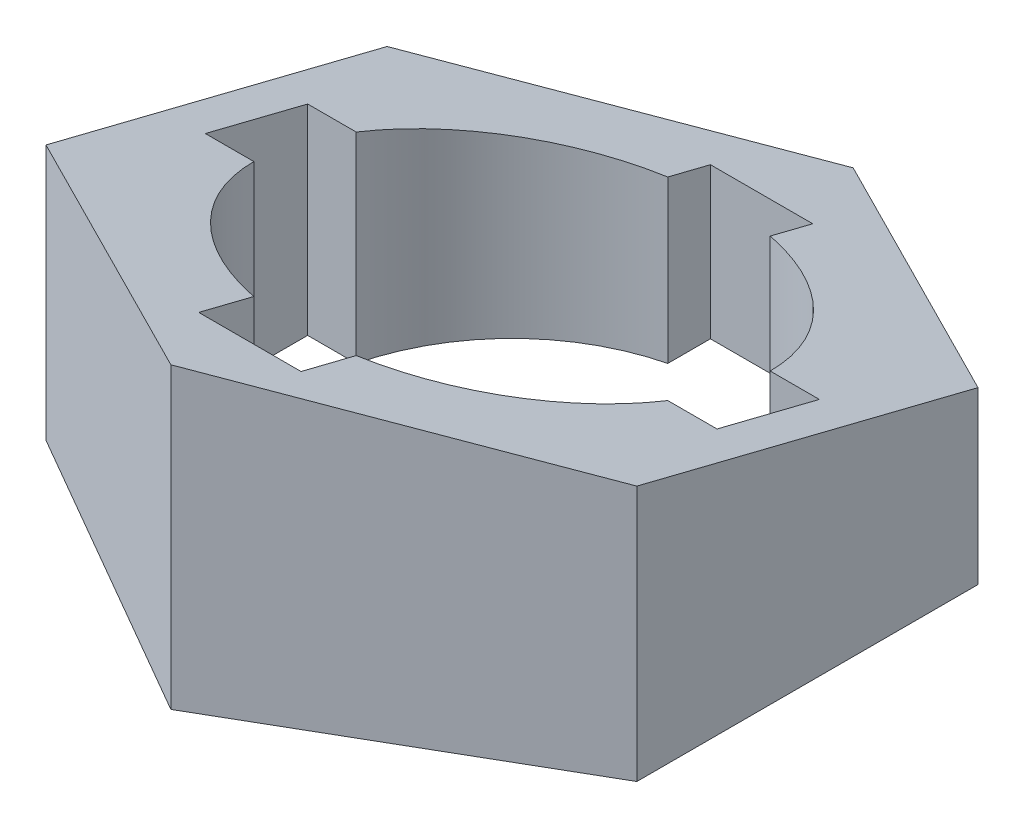
ISO-10303-21;
HEADER;
FILE_DESCRIPTION(('STEP AP214'),'2;1');
FILE_NAME('part.step','',(''),(''),'','','');
FILE_SCHEMA(('AUTOMOTIVE_DESIGN { 1 0 10303 214 1 1 1 1 }'));
ENDSEC;
DATA;
#1=APPLICATION_CONTEXT('core data for automotive mechanical design processes');
#2=APPLICATION_PROTOCOL_DEFINITION('international standard','automotive_design',2000,#1);
#3=PRODUCT_CONTEXT('',#1,'mechanical');
#4=PRODUCT('Part','Part','',(#3));
#5=PRODUCT_RELATED_PRODUCT_CATEGORY('part','',(#4));
#6=PRODUCT_DEFINITION_FORMATION('','',#4);
#7=PRODUCT_DEFINITION_CONTEXT('part definition',#1,'design');
#8=PRODUCT_DEFINITION('design','',#6,#7);
#9=PRODUCT_DEFINITION_SHAPE('','',#8);
#10=(LENGTH_UNIT() NAMED_UNIT(*) SI_UNIT(.MILLI.,.METRE.));
#11=(NAMED_UNIT(*) PLANE_ANGLE_UNIT() SI_UNIT($,.RADIAN.));
#12=(NAMED_UNIT(*) SI_UNIT($,.STERADIAN.) SOLID_ANGLE_UNIT());
#13=UNCERTAINTY_MEASURE_WITH_UNIT(LENGTH_MEASURE(1.E-05),#10,'distance_accuracy_value','');
#14=(GEOMETRIC_REPRESENTATION_CONTEXT(3) GLOBAL_UNCERTAINTY_ASSIGNED_CONTEXT((#13)) GLOBAL_UNIT_ASSIGNED_CONTEXT((#10,
#11,#12)) REPRESENTATION_CONTEXT('',''));
#15=CARTESIAN_POINT('',(0.,0.,0.));
#16=DIRECTION('',(0.,0.,1.));
#17=DIRECTION('',(1.,0.,0.));
#18=AXIS2_PLACEMENT_3D('',#15,#16,#17);
#19=CARTESIAN_POINT('',(34.6410161513773,35.,-20.0000000000004));
#20=DIRECTION('',(-0.499999999999995,0.,0.866025403784441));
#21=DIRECTION('',(0.866025403784441,0.,0.499999999999995));
#22=AXIS2_PLACEMENT_3D('',#19,#20,#21);
#23=PLANE('',#22);
#24=DIRECTION('',(-0.859337848847322,-0.124034734589208,-0.496138938356829));
#25=VECTOR('',#24,1.);
#26=CARTESIAN_POINT('',(36.2398322814409,20.2307692307692,-19.0769230769235));
#27=LINE('',#26,#25);
#28=CARTESIAN_POINT('',(34.6410161513778,19.9999999999999,-20.0000000000004));
#29=VERTEX_POINT('',#28);
#30=CARTESIAN_POINT('',(0.,15.,-40.));
#31=VERTEX_POINT('',#30);
#32=EDGE_CURVE('E328',#29,#31,#27,.T.);
#33=ORIENTED_EDGE('',*,*,#32,.F.);
#34=DIRECTION('',(0.,-1.,0.));
#35=VECTOR('',#34,1.);
#36=CARTESIAN_POINT('',(34.6410161513773,35.,-20.0000000000004));
#37=LINE('',#36,#35);
#38=CARTESIAN_POINT('',(34.6410161513773,0.,-20.0000000000004));
#39=VERTEX_POINT('',#38);
#40=EDGE_CURVE('E218',#29,#39,#37,.T.);
#41=ORIENTED_EDGE('',*,*,#40,.T.);
#42=DIRECTION('',(-0.866025403784441,0.,-0.499999999999995));
#43=VECTOR('',#42,1.);
#44=CARTESIAN_POINT('',(34.6410161513773,0.,-20.0000000000004));
#45=LINE('',#44,#43);
#46=CARTESIAN_POINT('',(0.,0.,-40.));
#47=VERTEX_POINT('',#46);
#48=EDGE_CURVE('E240',#39,#47,#45,.T.);
#49=ORIENTED_EDGE('',*,*,#48,.T.);
#50=DIRECTION('',(0.,-1.,0.));
#51=VECTOR('',#50,1.);
#52=CARTESIAN_POINT('',(0.,35.,-40.));
#53=LINE('',#52,#51);
#54=EDGE_CURVE('E49',#31,#47,#53,.T.);
#55=ORIENTED_EDGE('',*,*,#54,.F.);
#56=EDGE_LOOP('',(#33,#41,#49,#55));
#57=FACE_BOUND('',#56,.T.);
#58=ADVANCED_FACE('F41',(#57),#23,.F.);
#59=CARTESIAN_POINT('',(0.,35.,-40.));
#60=DIRECTION('',(0.500000000000001,0.,0.866025403784438));
#61=DIRECTION('',(0.866025403784438,0.,-0.500000000000001));
#62=AXIS2_PLACEMENT_3D('',#59,#60,#61);
#63=PLANE('',#62);
#64=DIRECTION('',(-0.859337848847319,0.124034734589208,0.496138938356835));
#65=VECTOR('',#64,1.);
#66=CARTESIAN_POINT('',(-2.13175484008476,15.3076923076923,-38.7692307692308));
#67=LINE('',#66,#65);
#68=CARTESIAN_POINT('',(-34.6410161513776,20.,-19.9999999999999));
#69=VERTEX_POINT('',#68);
#70=EDGE_CURVE('E195',#31,#69,#67,.T.);
#71=ORIENTED_EDGE('',*,*,#70,.F.);
#72=ORIENTED_EDGE('',*,*,#54,.T.);
#73=DIRECTION('',(-0.866025403784438,0.,0.500000000000001));
#74=VECTOR('',#73,1.);
#75=CARTESIAN_POINT('',(0.,0.,-40.));
#76=LINE('',#75,#74);
#77=CARTESIAN_POINT('',(-34.6410161513776,0.,-19.9999999999999));
#78=VERTEX_POINT('',#77);
#79=EDGE_CURVE('E231',#47,#78,#76,.T.);
#80=ORIENTED_EDGE('',*,*,#79,.T.);
#81=DIRECTION('',(0.,-1.,0.));
#82=VECTOR('',#81,1.);
#83=CARTESIAN_POINT('',(-34.6410161513776,35.,-19.9999999999999));
#84=LINE('',#83,#82);
#85=EDGE_CURVE('E216',#69,#78,#84,.T.);
#86=ORIENTED_EDGE('',*,*,#85,.F.);
#87=EDGE_LOOP('',(#71,#72,#80,#86));
#88=FACE_BOUND('',#87,.T.);
#89=ADVANCED_FACE('F229',(#88),#63,.F.);
#90=CARTESIAN_POINT('',(-34.6410161513776,35.,-19.9999999999999));
#91=DIRECTION('',(1.,0.,0.));
#92=DIRECTION('',(0.,0.,-1.));
#93=AXIS2_PLACEMENT_3D('',#90,#91,#92);
#94=PLANE('',#93);
#95=DIRECTION('',(0.,-0.242535625036333,-0.970142500145332));
#96=VECTOR('',#95,1.);
#97=CARTESIAN_POINT('',(-34.6410161513775,23.5294117647059,-5.88235294117636));
#98=LINE('',#97,#96);
#99=CARTESIAN_POINT('',(-34.6410161513775,30.,20.0000000000002));
#100=VERTEX_POINT('',#99);
#101=EDGE_CURVE('E190',#100,#69,#98,.T.);
#102=ORIENTED_EDGE('',*,*,#101,.T.);
#103=ORIENTED_EDGE('',*,*,#85,.T.);
#104=DIRECTION('',(0.,0.,1.));
#105=VECTOR('',#104,1.);
#106=CARTESIAN_POINT('',(-34.6410161513776,0.,-19.9999999999999));
#107=LINE('',#106,#105);
#108=CARTESIAN_POINT('',(-34.6410161513775,0.,20.0000000000002));
#109=VERTEX_POINT('',#108);
#110=EDGE_CURVE('E242',#78,#109,#107,.T.);
#111=ORIENTED_EDGE('',*,*,#110,.T.);
#112=DIRECTION('',(0.,-1.,0.));
#113=VECTOR('',#112,1.);
#114=CARTESIAN_POINT('',(-34.6410161513775,35.,20.0000000000002));
#115=LINE('',#114,#113);
#116=EDGE_CURVE('E212',#100,#109,#115,.T.);
#117=ORIENTED_EDGE('',*,*,#116,.F.);
#118=EDGE_LOOP('',(#102,#103,#111,#117));
#119=FACE_BOUND('',#118,.T.);
#120=ADVANCED_FACE('F518',(#119),#94,.F.);
#121=CARTESIAN_POINT('',(-34.6410161513775,35.,20.0000000000002));
#122=DIRECTION('',(0.499999999999995,0.,-0.866025403784442));
#123=DIRECTION('',(-0.866025403784442,0.,-0.499999999999995));
#124=AXIS2_PLACEMENT_3D('',#121,#122,#123);
#125=PLANE('',#124);
#126=DIRECTION('',(0.859337848847322,0.124034734589208,0.496138938356829));
#127=VECTOR('',#126,1.);
#128=CARTESIAN_POINT('',(-34.1080774413563,30.0769230769231,20.3076923076925));
#129=LINE('',#128,#127);
#130=CARTESIAN_POINT('',(2.77555756156289E-13,35.,40.));
#131=VERTEX_POINT('',#130);
#132=EDGE_CURVE('E187',#100,#131,#129,.T.);
#133=ORIENTED_EDGE('',*,*,#132,.F.);
#134=ORIENTED_EDGE('',*,*,#116,.T.);
#135=DIRECTION('',(0.866025403784442,0.,0.499999999999995));
#136=VECTOR('',#135,1.);
#137=CARTESIAN_POINT('',(-34.6410161513775,0.,20.0000000000002));
#138=LINE('',#137,#136);
#139=CARTESIAN_POINT('',(2.79318507107451E-13,0.,40.));
#140=VERTEX_POINT('',#139);
#141=EDGE_CURVE('E210',#109,#140,#138,.T.);
#142=ORIENTED_EDGE('',*,*,#141,.T.);
#143=DIRECTION('',(0.,-1.,0.));
#144=VECTOR('',#143,1.);
#145=CARTESIAN_POINT('',(2.79318507107451E-13,35.,40.));
#146=LINE('',#145,#144);
#147=EDGE_CURVE('E202',#131,#140,#146,.T.);
#148=ORIENTED_EDGE('',*,*,#147,.F.);
#149=EDGE_LOOP('',(#133,#134,#142,#148));
#150=FACE_BOUND('',#149,.T.);
#151=ADVANCED_FACE('F208',(#150),#125,.F.);
#152=CARTESIAN_POINT('',(2.79318507107451E-13,35.,40.));
#153=DIRECTION('',(-0.500000000000007,0.,-0.866025403784435));
#154=DIRECTION('',(-0.866025403784435,0.,0.500000000000007));
#155=AXIS2_PLACEMENT_3D('',#152,#153,#154);
#156=PLANE('',#155);
#157=DIRECTION('',(0.859337848847315,-0.124034734589209,-0.496138938356841));
#158=VECTOR('',#157,1.);
#159=CARTESIAN_POINT('',(2.79318507107451E-13,35.,40.));
#160=LINE('',#159,#158);
#161=CARTESIAN_POINT('',(34.6410161513777,30.,19.9999999999997));
#162=VERTEX_POINT('',#161);
#163=EDGE_CURVE('E56',#131,#162,#160,.T.);
#164=ORIENTED_EDGE('',*,*,#163,.F.);
#165=ORIENTED_EDGE('',*,*,#147,.T.);
#166=DIRECTION('',(0.866025403784435,0.,-0.500000000000007));
#167=VECTOR('',#166,1.);
#168=CARTESIAN_POINT('',(2.79318507107451E-13,0.,40.));
#169=LINE('',#168,#167);
#170=CARTESIAN_POINT('',(34.6410161513777,0.,19.9999999999997));
#171=VERTEX_POINT('',#170);
#172=EDGE_CURVE('E262',#140,#171,#169,.T.);
#173=ORIENTED_EDGE('',*,*,#172,.T.);
#174=DIRECTION('',(0.,-1.,0.));
#175=VECTOR('',#174,1.);
#176=CARTESIAN_POINT('',(34.6410161513777,35.,19.9999999999997));
#177=LINE('',#176,#175);
#178=EDGE_CURVE('E204',#162,#171,#177,.T.);
#179=ORIENTED_EDGE('',*,*,#178,.F.);
#180=EDGE_LOOP('',(#164,#165,#173,#179));
#181=FACE_BOUND('',#180,.T.);
#182=ADVANCED_FACE('F200',(#181),#156,.F.);
#183=CARTESIAN_POINT('',(34.6410161513777,35.,19.9999999999997));
#184=DIRECTION('',(-1.,0.,0.));
#185=DIRECTION('',(0.,0.,1.));
#186=AXIS2_PLACEMENT_3D('',#183,#184,#185);
#187=PLANE('',#186);
#188=DIRECTION('',(0.,-0.242535625036333,-0.970142500145332));
#189=VECTOR('',#188,1.);
#190=CARTESIAN_POINT('',(34.6410161513778,23.5294117647059,-5.88235294117659));
#191=LINE('',#190,#189);
#192=EDGE_CURVE('E270',#162,#29,#191,.T.);
#193=ORIENTED_EDGE('',*,*,#192,.F.);
#194=ORIENTED_EDGE('',*,*,#178,.T.);
#195=DIRECTION('',(0.,0.,-1.));
#196=VECTOR('',#195,1.);
#197=CARTESIAN_POINT('',(34.6410161513777,0.,19.9999999999997));
#198=LINE('',#197,#196);
#199=EDGE_CURVE('E265',#171,#39,#198,.T.);
#200=ORIENTED_EDGE('',*,*,#199,.T.);
#201=ORIENTED_EDGE('',*,*,#40,.F.);
#202=EDGE_LOOP('',(#193,#194,#200,#201));
#203=FACE_BOUND('',#202,.T.);
#204=ADVANCED_FACE('F269',(#203),#187,.F.);
#205=CARTESIAN_POINT('',(-6.,0.,30.7340250650547));
#206=DIRECTION('',(0.,0.,1.));
#207=DIRECTION('',(1.,0.,0.));
#208=AXIS2_PLACEMENT_3D('',#205,#206,#207);
#209=PLANE('',#208);
#210=DIRECTION('',(-1.,0.,0.));
#211=VECTOR('',#210,1.);
#212=CARTESIAN_POINT('',(-6.00000000000003,32.6835062662637,30.7340250650547));
#213=LINE('',#212,#211);
#214=CARTESIAN_POINT('',(6.,32.6835062662637,30.7340250650547));
#215=VERTEX_POINT('',#214);
#216=CARTESIAN_POINT('',(-6.,32.6835062662637,30.7340250650547));
#217=VERTEX_POINT('',#216);
#218=EDGE_CURVE('E206',#215,#217,#213,.T.);
#219=ORIENTED_EDGE('',*,*,#218,.F.);
#220=DIRECTION('',(0.,1.,0.));
#221=VECTOR('',#220,1.);
#222=CARTESIAN_POINT('',(6.,0.,30.7340250650547));
#223=LINE('',#222,#221);
#224=CARTESIAN_POINT('',(6.,0.,30.7340250650547));
#225=VERTEX_POINT('',#224);
#226=EDGE_CURVE('E255',#225,#215,#223,.T.);
#227=ORIENTED_EDGE('',*,*,#226,.F.);
#228=DIRECTION('',(1.,0.,0.));
#229=VECTOR('',#228,1.);
#230=CARTESIAN_POINT('',(-6.,0.,30.7340250650547));
#231=LINE('',#230,#229);
#232=CARTESIAN_POINT('',(-6.,0.,30.7340250650547));
#233=VERTEX_POINT('',#232);
#234=EDGE_CURVE('E331',#233,#225,#231,.T.);
#235=ORIENTED_EDGE('',*,*,#234,.F.);
#236=DIRECTION('',(0.,1.,0.));
#237=VECTOR('',#236,1.);
#238=CARTESIAN_POINT('',(-6.,0.,30.7340250650547));
#239=LINE('',#238,#237);
#240=EDGE_CURVE('E248',#233,#217,#239,.T.);
#241=ORIENTED_EDGE('',*,*,#240,.T.);
#242=EDGE_LOOP('',(#219,#227,#235,#241));
#243=FACE_BOUND('',#242,.T.);
#244=ADVANCED_FACE('F451',(#243),#209,.F.);
#245=CARTESIAN_POINT('',(-6.,0.,30.7340250650547));
#246=DIRECTION('',(1.,0.,0.));
#247=DIRECTION('',(0.,0.,-1.));
#248=AXIS2_PLACEMENT_3D('',#245,#246,#247);
#249=PLANE('',#248);
#250=DIRECTION('',(0.,1.,0.));
#251=VECTOR('',#250,1.);
#252=CARTESIAN_POINT('',(-6.00000000000001,0.,24.2693221990232));
#253=LINE('',#252,#251);
#254=CARTESIAN_POINT('',(-6.00000000000001,0.,24.2693221990232));
#255=VERTEX_POINT('',#254);
#256=CARTESIAN_POINT('',(-6.00000000000001,31.0673305497558,24.2693221990232));
#257=VERTEX_POINT('',#256);
#258=EDGE_CURVE('E252',#255,#257,#253,.T.);
#259=ORIENTED_EDGE('',*,*,#258,.T.);
#260=DIRECTION('',(0.,0.242535625036333,0.970142500145332));
#261=VECTOR('',#260,1.);
#262=CARTESIAN_POINT('',(-6.,30.7609470741305,23.0437882965221));
#263=LINE('',#262,#261);
#264=EDGE_CURVE('E320',#257,#217,#263,.T.);
#265=ORIENTED_EDGE('',*,*,#264,.T.);
#266=ORIENTED_EDGE('',*,*,#240,.F.);
#267=DIRECTION('',(0.,0.,-1.));
#268=VECTOR('',#267,1.);
#269=CARTESIAN_POINT('',(-6.,0.,30.7340250650547));
#270=LINE('',#269,#268);
#271=EDGE_CURVE('E385',#233,#255,#270,.T.);
#272=ORIENTED_EDGE('',*,*,#271,.T.);
#273=EDGE_LOOP('',(#259,#265,#266,#272));
#274=FACE_BOUND('',#273,.T.);
#275=ADVANCED_FACE('F455',(#274),#249,.T.);
#276=CARTESIAN_POINT('',(0.,0.,0.));
#277=DIRECTION('',(0.,1.,0.));
#278=DIRECTION('',(0.,0.,1.));
#279=AXIS2_PLACEMENT_3D('',#276,#277,#278);
#280=CYLINDRICAL_SURFACE('',#279,25.);
#281=CARTESIAN_POINT('',(0.,25.,0.));
#282=DIRECTION('',(0.,0.970142500145332,-0.242535625036333));
#283=DIRECTION('',(0.,0.242535625036333,0.970142500145332));
#284=AXIS2_PLACEMENT_3D('',#281,#282,#283);
#285=ELLIPSE('',#284,25.7694101601104,25.);
#286=CARTESIAN_POINT('',(-24.2693221990232,26.5,6.));
#287=VERTEX_POINT('',#286);
#288=EDGE_CURVE('E317',#257,#287,#285,.F.);
#289=ORIENTED_EDGE('',*,*,#288,.F.);
#290=ORIENTED_EDGE('',*,*,#258,.F.);
#291=CARTESIAN_POINT('',(0.,0.,0.));
#292=DIRECTION('',(0.,1.,0.));
#293=DIRECTION('',(0.,0.,1.));
#294=AXIS2_PLACEMENT_3D('',#291,#292,#293);
#295=CIRCLE('',#294,25.);
#296=CARTESIAN_POINT('',(-24.2693221990232,0.,6.));
#297=VERTEX_POINT('',#296);
#298=EDGE_CURVE('E381',#297,#255,#295,.T.);
#299=ORIENTED_EDGE('',*,*,#298,.F.);
#300=DIRECTION('',(0.,1.,0.));
#301=VECTOR('',#300,1.);
#302=CARTESIAN_POINT('',(-24.2693221990232,0.,6.));
#303=LINE('',#302,#301);
#304=EDGE_CURVE('E391',#297,#287,#303,.T.);
#305=ORIENTED_EDGE('',*,*,#304,.T.);
#306=EDGE_LOOP('',(#289,#290,#299,#305));
#307=FACE_BOUND('',#306,.T.);
#308=ADVANCED_FACE('F459',(#307),#280,.F.);
#309=CARTESIAN_POINT('',(-29.959606462965,0.,6.));
#310=DIRECTION('',(0.,0.,1.));
#311=DIRECTION('',(1.,0.,0.));
#312=AXIS2_PLACEMENT_3D('',#309,#310,#311);
#313=PLANE('',#312);
#314=DIRECTION('',(-1.,0.,0.));
#315=VECTOR('',#314,1.);
#316=CARTESIAN_POINT('',(-29.9596064629651,26.5,6.));
#317=LINE('',#316,#315);
#318=CARTESIAN_POINT('',(-29.959606462965,26.5,6.));
#319=VERTEX_POINT('',#318);
#320=EDGE_CURVE('E314',#287,#319,#317,.T.);
#321=ORIENTED_EDGE('',*,*,#320,.F.);
#322=ORIENTED_EDGE('',*,*,#304,.F.);
#323=DIRECTION('',(1.,0.,0.));
#324=VECTOR('',#323,1.);
#325=CARTESIAN_POINT('',(-29.959606462965,0.,6.));
#326=LINE('',#325,#324);
#327=CARTESIAN_POINT('',(-29.959606462965,0.,6.));
#328=VERTEX_POINT('',#327);
#329=EDGE_CURVE('E377',#328,#297,#326,.T.);
#330=ORIENTED_EDGE('',*,*,#329,.F.);
#331=DIRECTION('',(0.,1.,0.));
#332=VECTOR('',#331,1.);
#333=CARTESIAN_POINT('',(-29.959606462965,0.,6.));
#334=LINE('',#333,#332);
#335=EDGE_CURVE('E395',#328,#319,#334,.T.);
#336=ORIENTED_EDGE('',*,*,#335,.T.);
#337=EDGE_LOOP('',(#321,#322,#330,#336));
#338=FACE_BOUND('',#337,.T.);
#339=ADVANCED_FACE('F466',(#338),#313,.F.);
#340=CARTESIAN_POINT('',(-29.959606462965,0.,6.));
#341=DIRECTION('',(1.,0.,0.));
#342=DIRECTION('',(0.,0.,-1.));
#343=AXIS2_PLACEMENT_3D('',#340,#341,#342);
#344=PLANE('',#343);
#345=DIRECTION('',(0.,1.,0.));
#346=VECTOR('',#345,1.);
#347=CARTESIAN_POINT('',(-29.959606462965,0.,-6.));
#348=LINE('',#347,#346);
#349=CARTESIAN_POINT('',(-29.959606462965,0.,-6.));
#350=VERTEX_POINT('',#349);
#351=CARTESIAN_POINT('',(-29.959606462965,23.5,-6.));
#352=VERTEX_POINT('',#351);
#353=EDGE_CURVE('E399',#350,#352,#348,.T.);
#354=ORIENTED_EDGE('',*,*,#353,.T.);
#355=DIRECTION('',(0.,0.242535625036333,0.970142500145332));
#356=VECTOR('',#355,1.);
#357=CARTESIAN_POINT('',(-29.959606462965,24.9411764705882,-0.235294117647055));
#358=LINE('',#357,#356);
#359=EDGE_CURVE('E310',#352,#319,#358,.T.);
#360=ORIENTED_EDGE('',*,*,#359,.T.);
#361=ORIENTED_EDGE('',*,*,#335,.F.);
#362=DIRECTION('',(0.,0.,-1.));
#363=VECTOR('',#362,1.);
#364=CARTESIAN_POINT('',(-29.959606462965,0.,6.));
#365=LINE('',#364,#363);
#366=EDGE_CURVE('E374',#328,#350,#365,.T.);
#367=ORIENTED_EDGE('',*,*,#366,.T.);
#368=EDGE_LOOP('',(#354,#360,#361,#367));
#369=FACE_BOUND('',#368,.T.);
#370=ADVANCED_FACE('F468',(#369),#344,.T.);
#371=CARTESIAN_POINT('',(-29.959606462965,0.,-6.));
#372=DIRECTION('',(0.,0.,1.));
#373=DIRECTION('',(1.,0.,0.));
#374=AXIS2_PLACEMENT_3D('',#371,#372,#373);
#375=PLANE('',#374);
#376=DIRECTION('',(0.,1.,0.));
#377=VECTOR('',#376,1.);
#378=CARTESIAN_POINT('',(-24.2693221990232,0.,-6.00000000000001));
#379=LINE('',#378,#377);
#380=CARTESIAN_POINT('',(-24.2693221990232,0.,-6.00000000000001));
#381=VERTEX_POINT('',#380);
#382=CARTESIAN_POINT('',(-24.2693221990232,23.5,-6.00000000000001));
#383=VERTEX_POINT('',#382);
#384=EDGE_CURVE('E403',#381,#383,#379,.T.);
#385=ORIENTED_EDGE('',*,*,#384,.T.);
#386=DIRECTION('',(-1.,0.,0.));
#387=VECTOR('',#386,1.);
#388=CARTESIAN_POINT('',(-29.9596064629651,23.5,-6.));
#389=LINE('',#388,#387);
#390=EDGE_CURVE('E306',#383,#352,#389,.T.);
#391=ORIENTED_EDGE('',*,*,#390,.T.);
#392=ORIENTED_EDGE('',*,*,#353,.F.);
#393=DIRECTION('',(1.,0.,0.));
#394=VECTOR('',#393,1.);
#395=CARTESIAN_POINT('',(-29.959606462965,0.,-6.));
#396=LINE('',#395,#394);
#397=EDGE_CURVE('E371',#350,#381,#396,.T.);
#398=ORIENTED_EDGE('',*,*,#397,.T.);
#399=EDGE_LOOP('',(#385,#391,#392,#398));
#400=FACE_BOUND('',#399,.T.);
#401=ADVANCED_FACE('F471',(#400),#375,.T.);
#402=CARTESIAN_POINT('',(0.,0.,0.));
#403=DIRECTION('',(0.,1.,0.));
#404=DIRECTION('',(0.,0.,1.));
#405=AXIS2_PLACEMENT_3D('',#402,#403,#404);
#406=CYLINDRICAL_SURFACE('',#405,25.);
#407=CARTESIAN_POINT('',(0.,25.,0.));
#408=DIRECTION('',(0.,0.970142500145332,-0.242535625036333));
#409=DIRECTION('',(0.,0.242535625036333,0.970142500145332));
#410=AXIS2_PLACEMENT_3D('',#407,#408,#409);
#411=ELLIPSE('',#410,25.7694101601104,25.);
#412=CARTESIAN_POINT('',(-6.,18.9326694502442,-24.2693221990232));
#413=VERTEX_POINT('',#412);
#414=EDGE_CURVE('E303',#383,#413,#411,.F.);
#415=ORIENTED_EDGE('',*,*,#414,.F.);
#416=ORIENTED_EDGE('',*,*,#384,.F.);
#417=CARTESIAN_POINT('',(0.,0.,0.));
#418=DIRECTION('',(0.,1.,0.));
#419=DIRECTION('',(0.,0.,1.));
#420=AXIS2_PLACEMENT_3D('',#417,#418,#419);
#421=CIRCLE('',#420,25.);
#422=CARTESIAN_POINT('',(-6.,0.,-24.2693221990232));
#423=VERTEX_POINT('',#422);
#424=EDGE_CURVE('E367',#423,#381,#421,.T.);
#425=ORIENTED_EDGE('',*,*,#424,.F.);
#426=DIRECTION('',(0.,1.,0.));
#427=VECTOR('',#426,1.);
#428=CARTESIAN_POINT('',(-6.,0.,-24.2693221990232));
#429=LINE('',#428,#427);
#430=EDGE_CURVE('E407',#423,#413,#429,.T.);
#431=ORIENTED_EDGE('',*,*,#430,.T.);
#432=EDGE_LOOP('',(#415,#416,#425,#431));
#433=FACE_BOUND('',#432,.T.);
#434=ADVANCED_FACE('F478',(#433),#406,.F.);
#435=CARTESIAN_POINT('',(-6.,0.,-29.2659749349453));
#436=DIRECTION('',(-1.,0.,0.));
#437=DIRECTION('',(0.,0.,1.));
#438=AXIS2_PLACEMENT_3D('',#435,#436,#437);
#439=PLANE('',#438);
#440=DIRECTION('',(0.,-0.242535625036333,-0.970142500145332));
#441=VECTOR('',#440,1.);
#442=CARTESIAN_POINT('',(-6.,16.643300015307,-33.426799938772));
#443=LINE('',#442,#441);
#444=CARTESIAN_POINT('',(-6.,17.6835062662637,-29.2659749349453));
#445=VERTEX_POINT('',#444);
#446=EDGE_CURVE('E300',#413,#445,#443,.T.);
#447=ORIENTED_EDGE('',*,*,#446,.F.);
#448=ORIENTED_EDGE('',*,*,#430,.F.);
#449=DIRECTION('',(0.,0.,1.));
#450=VECTOR('',#449,1.);
#451=CARTESIAN_POINT('',(-6.,0.,-29.2659749349453));
#452=LINE('',#451,#450);
#453=CARTESIAN_POINT('',(-6.,0.,-29.2659749349453));
#454=VERTEX_POINT('',#453);
#455=EDGE_CURVE('E363',#454,#423,#452,.T.);
#456=ORIENTED_EDGE('',*,*,#455,.F.);
#457=DIRECTION('',(0.,1.,0.));
#458=VECTOR('',#457,1.);
#459=CARTESIAN_POINT('',(-6.,0.,-29.2659749349453));
#460=LINE('',#459,#458);
#461=EDGE_CURVE('E411',#454,#445,#460,.T.);
#462=ORIENTED_EDGE('',*,*,#461,.T.);
#463=EDGE_LOOP('',(#447,#448,#456,#462));
#464=FACE_BOUND('',#463,.T.);
#465=ADVANCED_FACE('F481',(#464),#439,.F.);
#466=CARTESIAN_POINT('',(-6.,0.,-29.2659749349453));
#467=DIRECTION('',(0.,0.,1.));
#468=DIRECTION('',(1.,0.,0.));
#469=AXIS2_PLACEMENT_3D('',#466,#467,#468);
#470=PLANE('',#469);
#471=DIRECTION('',(0.,1.,0.));
#472=VECTOR('',#471,1.);
#473=CARTESIAN_POINT('',(6.,0.,-29.2659749349453));
#474=LINE('',#473,#472);
#475=CARTESIAN_POINT('',(6.,0.,-29.2659749349453));
#476=VERTEX_POINT('',#475);
#477=CARTESIAN_POINT('',(6.,17.6835062662637,-29.2659749349453));
#478=VERTEX_POINT('',#477);
#479=EDGE_CURVE('E415',#476,#478,#474,.T.);
#480=ORIENTED_EDGE('',*,*,#479,.T.);
#481=DIRECTION('',(-1.,0.,0.));
#482=VECTOR('',#481,1.);
#483=CARTESIAN_POINT('',(-6.00000000000002,17.6835062662637,-29.2659749349453));
#484=LINE('',#483,#482);
#485=EDGE_CURVE('E296',#478,#445,#484,.T.);
#486=ORIENTED_EDGE('',*,*,#485,.T.);
#487=ORIENTED_EDGE('',*,*,#461,.F.);
#488=DIRECTION('',(1.,0.,0.));
#489=VECTOR('',#488,1.);
#490=CARTESIAN_POINT('',(-6.,0.,-29.2659749349453));
#491=LINE('',#490,#489);
#492=EDGE_CURVE('E360',#454,#476,#491,.T.);
#493=ORIENTED_EDGE('',*,*,#492,.T.);
#494=EDGE_LOOP('',(#480,#486,#487,#493));
#495=FACE_BOUND('',#494,.T.);
#496=ADVANCED_FACE('F483',(#495),#470,.T.);
#497=CARTESIAN_POINT('',(6.,0.,-29.2659749349453));
#498=DIRECTION('',(-1.,0.,0.));
#499=DIRECTION('',(0.,0.,1.));
#500=AXIS2_PLACEMENT_3D('',#497,#498,#499);
#501=PLANE('',#500);
#502=DIRECTION('',(0.,1.,0.));
#503=VECTOR('',#502,1.);
#504=CARTESIAN_POINT('',(6.,0.,-24.2693221990232));
#505=LINE('',#504,#503);
#506=CARTESIAN_POINT('',(6.,0.,-24.2693221990232));
#507=VERTEX_POINT('',#506);
#508=CARTESIAN_POINT('',(6.,18.9326694502442,-24.2693221990232));
#509=VERTEX_POINT('',#508);
#510=EDGE_CURVE('E419',#507,#509,#505,.T.);
#511=ORIENTED_EDGE('',*,*,#510,.T.);
#512=DIRECTION('',(0.,-0.242535625036333,-0.970142500145332));
#513=VECTOR('',#512,1.);
#514=CARTESIAN_POINT('',(6.,16.643300015307,-33.426799938772));
#515=LINE('',#514,#513);
#516=EDGE_CURVE('E292',#509,#478,#515,.T.);
#517=ORIENTED_EDGE('',*,*,#516,.T.);
#518=ORIENTED_EDGE('',*,*,#479,.F.);
#519=DIRECTION('',(0.,0.,1.));
#520=VECTOR('',#519,1.);
#521=CARTESIAN_POINT('',(6.,0.,-29.2659749349453));
#522=LINE('',#521,#520);
#523=EDGE_CURVE('E357',#476,#507,#522,.T.);
#524=ORIENTED_EDGE('',*,*,#523,.T.);
#525=EDGE_LOOP('',(#511,#517,#518,#524));
#526=FACE_BOUND('',#525,.T.);
#527=ADVANCED_FACE('F487',(#526),#501,.T.);
#528=CARTESIAN_POINT('',(0.,0.,0.));
#529=DIRECTION('',(0.,1.,0.));
#530=DIRECTION('',(0.,0.,1.));
#531=AXIS2_PLACEMENT_3D('',#528,#529,#530);
#532=CYLINDRICAL_SURFACE('',#531,25.);
#533=CARTESIAN_POINT('',(0.,25.,0.));
#534=DIRECTION('',(0.,0.970142500145332,-0.242535625036333));
#535=DIRECTION('',(0.,0.242535625036333,0.970142500145332));
#536=AXIS2_PLACEMENT_3D('',#533,#534,#535);
#537=ELLIPSE('',#536,25.7694101601104,25.);
#538=CARTESIAN_POINT('',(24.2693221990232,23.5,-6.));
#539=VERTEX_POINT('',#538);
#540=EDGE_CURVE('E289',#509,#539,#537,.F.);
#541=ORIENTED_EDGE('',*,*,#540,.F.);
#542=ORIENTED_EDGE('',*,*,#510,.F.);
#543=CARTESIAN_POINT('',(0.,0.,0.));
#544=DIRECTION('',(0.,1.,0.));
#545=DIRECTION('',(0.,0.,1.));
#546=AXIS2_PLACEMENT_3D('',#543,#544,#545);
#547=CIRCLE('',#546,25.);
#548=CARTESIAN_POINT('',(24.2693221990232,0.,-6.));
#549=VERTEX_POINT('',#548);
#550=EDGE_CURVE('E353',#549,#507,#547,.T.);
#551=ORIENTED_EDGE('',*,*,#550,.F.);
#552=DIRECTION('',(0.,1.,0.));
#553=VECTOR('',#552,1.);
#554=CARTESIAN_POINT('',(24.2693221990232,0.,-6.));
#555=LINE('',#554,#553);
#556=EDGE_CURVE('E423',#549,#539,#555,.T.);
#557=ORIENTED_EDGE('',*,*,#556,.T.);
#558=EDGE_LOOP('',(#541,#542,#551,#557));
#559=FACE_BOUND('',#558,.T.);
#560=ADVANCED_FACE('F492',(#559),#532,.F.);
#561=CARTESIAN_POINT('',(30.040393537035,0.,-6.));
#562=DIRECTION('',(0.,0.,-1.));
#563=DIRECTION('',(-1.,0.,0.));
#564=AXIS2_PLACEMENT_3D('',#561,#562,#563);
#565=PLANE('',#564);
#566=DIRECTION('',(1.,0.,0.));
#567=VECTOR('',#566,1.);
#568=CARTESIAN_POINT('',(30.0403935370349,23.5,-6.));
#569=LINE('',#568,#567);
#570=CARTESIAN_POINT('',(30.040393537035,23.5,-6.));
#571=VERTEX_POINT('',#570);
#572=EDGE_CURVE('E286',#539,#571,#569,.T.);
#573=ORIENTED_EDGE('',*,*,#572,.F.);
#574=ORIENTED_EDGE('',*,*,#556,.F.);
#575=DIRECTION('',(-1.,0.,0.));
#576=VECTOR('',#575,1.);
#577=CARTESIAN_POINT('',(30.040393537035,0.,-6.));
#578=LINE('',#577,#576);
#579=CARTESIAN_POINT('',(30.040393537035,0.,-6.));
#580=VERTEX_POINT('',#579);
#581=EDGE_CURVE('E349',#580,#549,#578,.T.);
#582=ORIENTED_EDGE('',*,*,#581,.F.);
#583=DIRECTION('',(0.,1.,0.));
#584=VECTOR('',#583,1.);
#585=CARTESIAN_POINT('',(30.040393537035,0.,-6.));
#586=LINE('',#585,#584);
#587=EDGE_CURVE('E427',#580,#571,#586,.T.);
#588=ORIENTED_EDGE('',*,*,#587,.T.);
#589=EDGE_LOOP('',(#573,#574,#582,#588));
#590=FACE_BOUND('',#589,.T.);
#591=ADVANCED_FACE('F498',(#590),#565,.F.);
#592=CARTESIAN_POINT('',(30.040393537035,0.,-6.));
#593=DIRECTION('',(-1.,0.,0.));
#594=DIRECTION('',(0.,0.,1.));
#595=AXIS2_PLACEMENT_3D('',#592,#593,#594);
#596=PLANE('',#595);
#597=DIRECTION('',(0.,1.,0.));
#598=VECTOR('',#597,1.);
#599=CARTESIAN_POINT('',(30.040393537035,0.,6.));
#600=LINE('',#599,#598);
#601=CARTESIAN_POINT('',(30.040393537035,0.,6.));
#602=VERTEX_POINT('',#601);
#603=CARTESIAN_POINT('',(30.040393537035,26.5,6.));
#604=VERTEX_POINT('',#603);
#605=EDGE_CURVE('E431',#602,#604,#600,.T.);
#606=ORIENTED_EDGE('',*,*,#605,.T.);
#607=DIRECTION('',(0.,-0.242535625036333,-0.970142500145332));
#608=VECTOR('',#607,1.);
#609=CARTESIAN_POINT('',(30.040393537035,22.1176470588236,-11.5294117647059));
#610=LINE('',#609,#608);
#611=EDGE_CURVE('E282',#604,#571,#610,.T.);
#612=ORIENTED_EDGE('',*,*,#611,.T.);
#613=ORIENTED_EDGE('',*,*,#587,.F.);
#614=DIRECTION('',(0.,0.,1.));
#615=VECTOR('',#614,1.);
#616=CARTESIAN_POINT('',(30.040393537035,0.,-6.));
#617=LINE('',#616,#615);
#618=EDGE_CURVE('E346',#580,#602,#617,.T.);
#619=ORIENTED_EDGE('',*,*,#618,.T.);
#620=EDGE_LOOP('',(#606,#612,#613,#619));
#621=FACE_BOUND('',#620,.T.);
#622=ADVANCED_FACE('F500',(#621),#596,.T.);
#623=CARTESIAN_POINT('',(30.040393537035,0.,6.));
#624=DIRECTION('',(0.,0.,-1.));
#625=DIRECTION('',(-1.,0.,0.));
#626=AXIS2_PLACEMENT_3D('',#623,#624,#625);
#627=PLANE('',#626);
#628=DIRECTION('',(0.,1.,0.));
#629=VECTOR('',#628,1.);
#630=CARTESIAN_POINT('',(24.2693221990232,0.,6.));
#631=LINE('',#630,#629);
#632=CARTESIAN_POINT('',(24.2693221990232,0.,6.));
#633=VERTEX_POINT('',#632);
#634=CARTESIAN_POINT('',(24.2693221990232,26.5,6.));
#635=VERTEX_POINT('',#634);
#636=EDGE_CURVE('E435',#633,#635,#631,.T.);
#637=ORIENTED_EDGE('',*,*,#636,.T.);
#638=DIRECTION('',(1.,0.,0.));
#639=VECTOR('',#638,1.);
#640=CARTESIAN_POINT('',(30.0403935370349,26.5,6.));
#641=LINE('',#640,#639);
#642=EDGE_CURVE('E275',#635,#604,#641,.T.);
#643=ORIENTED_EDGE('',*,*,#642,.T.);
#644=ORIENTED_EDGE('',*,*,#605,.F.);
#645=DIRECTION('',(-1.,0.,0.));
#646=VECTOR('',#645,1.);
#647=CARTESIAN_POINT('',(30.040393537035,0.,6.));
#648=LINE('',#647,#646);
#649=EDGE_CURVE('E343',#602,#633,#648,.T.);
#650=ORIENTED_EDGE('',*,*,#649,.T.);
#651=EDGE_LOOP('',(#637,#643,#644,#650));
#652=FACE_BOUND('',#651,.T.);
#653=ADVANCED_FACE('F503',(#652),#627,.T.);
#654=CARTESIAN_POINT('',(0.,0.,0.));
#655=DIRECTION('',(0.,1.,0.));
#656=DIRECTION('',(0.,0.,1.));
#657=AXIS2_PLACEMENT_3D('',#654,#655,#656);
#658=CYLINDRICAL_SURFACE('',#657,25.);
#659=CARTESIAN_POINT('',(0.,25.,0.));
#660=DIRECTION('',(0.,0.970142500145332,-0.242535625036333));
#661=DIRECTION('',(0.,0.242535625036333,0.970142500145332));
#662=AXIS2_PLACEMENT_3D('',#659,#660,#661);
#663=ELLIPSE('',#662,25.7694101601104,25.);
#664=CARTESIAN_POINT('',(6.,31.0673305497558,24.2693221990232));
#665=VERTEX_POINT('',#664);
#666=EDGE_CURVE('E63',#635,#665,#663,.F.);
#667=ORIENTED_EDGE('',*,*,#666,.F.);
#668=ORIENTED_EDGE('',*,*,#636,.F.);
#669=CARTESIAN_POINT('',(0.,0.,0.));
#670=DIRECTION('',(0.,1.,0.));
#671=DIRECTION('',(0.,0.,1.));
#672=AXIS2_PLACEMENT_3D('',#669,#670,#671);
#673=CIRCLE('',#672,25.);
#674=CARTESIAN_POINT('',(6.,0.,24.2693221990232));
#675=VERTEX_POINT('',#674);
#676=EDGE_CURVE('E339',#675,#633,#673,.T.);
#677=ORIENTED_EDGE('',*,*,#676,.F.);
#678=DIRECTION('',(0.,1.,0.));
#679=VECTOR('',#678,1.);
#680=CARTESIAN_POINT('',(6.,0.,24.2693221990232));
#681=LINE('',#680,#679);
#682=EDGE_CURVE('E438',#675,#665,#681,.T.);
#683=ORIENTED_EDGE('',*,*,#682,.T.);
#684=EDGE_LOOP('',(#667,#668,#677,#683));
#685=FACE_BOUND('',#684,.T.);
#686=ADVANCED_FACE('F505',(#685),#658,.F.);
#687=CARTESIAN_POINT('',(6.,0.,30.7340250650547));
#688=DIRECTION('',(1.,0.,0.));
#689=DIRECTION('',(0.,0.,-1.));
#690=AXIS2_PLACEMENT_3D('',#687,#688,#689);
#691=PLANE('',#690);
#692=DIRECTION('',(0.,0.242535625036333,0.970142500145332));
#693=VECTOR('',#692,1.);
#694=CARTESIAN_POINT('',(6.,30.7609470741305,23.0437882965221));
#695=LINE('',#694,#693);
#696=EDGE_CURVE('E11',#665,#215,#695,.T.);
#697=ORIENTED_EDGE('',*,*,#696,.F.);
#698=ORIENTED_EDGE('',*,*,#682,.F.);
#699=DIRECTION('',(0.,0.,-1.));
#700=VECTOR('',#699,1.);
#701=CARTESIAN_POINT('',(6.,0.,30.7340250650547));
#702=LINE('',#701,#700);
#703=EDGE_CURVE('E335',#225,#675,#702,.T.);
#704=ORIENTED_EDGE('',*,*,#703,.F.);
#705=ORIENTED_EDGE('',*,*,#226,.T.);
#706=EDGE_LOOP('',(#697,#698,#704,#705));
#707=FACE_BOUND('',#706,.T.);
#708=ADVANCED_FACE('F447',(#707),#691,.F.);
#709=CARTESIAN_POINT('',(0.,0.,0.));
#710=DIRECTION('',(0.,1.,0.));
#711=DIRECTION('',(0.,0.,1.));
#712=AXIS2_PLACEMENT_3D('',#709,#710,#711);
#713=PLANE('',#712);
#714=ORIENTED_EDGE('',*,*,#271,.F.);
#715=ORIENTED_EDGE('',*,*,#234,.T.);
#716=ORIENTED_EDGE('',*,*,#703,.T.);
#717=ORIENTED_EDGE('',*,*,#676,.T.);
#718=ORIENTED_EDGE('',*,*,#649,.F.);
#719=ORIENTED_EDGE('',*,*,#618,.F.);
#720=ORIENTED_EDGE('',*,*,#581,.T.);
#721=ORIENTED_EDGE('',*,*,#550,.T.);
#722=ORIENTED_EDGE('',*,*,#523,.F.);
#723=ORIENTED_EDGE('',*,*,#492,.F.);
#724=ORIENTED_EDGE('',*,*,#455,.T.);
#725=ORIENTED_EDGE('',*,*,#424,.T.);
#726=ORIENTED_EDGE('',*,*,#397,.F.);
#727=ORIENTED_EDGE('',*,*,#366,.F.);
#728=ORIENTED_EDGE('',*,*,#329,.T.);
#729=ORIENTED_EDGE('',*,*,#298,.T.);
#730=EDGE_LOOP('',(#714,#715,#716,#717,#718,#719,#720,#721,#722,#723,#724,#725,#726,#727,#728,#729));
#731=FACE_BOUND('',#730,.T.);
#732=ORIENTED_EDGE('',*,*,#48,.F.);
#733=ORIENTED_EDGE('',*,*,#199,.F.);
#734=ORIENTED_EDGE('',*,*,#172,.F.);
#735=ORIENTED_EDGE('',*,*,#141,.F.);
#736=ORIENTED_EDGE('',*,*,#110,.F.);
#737=ORIENTED_EDGE('',*,*,#79,.F.);
#738=EDGE_LOOP('',(#732,#733,#734,#735,#736,#737));
#739=FACE_BOUND('',#738,.T.);
#740=ADVANCED_FACE('F238',(#731,#739),#713,.F.);
#741=CARTESIAN_POINT('',(34.6410161513778,23.5294117647059,-5.88235294117659));
#742=DIRECTION('',(0.,0.970142500145332,-0.242535625036333));
#743=DIRECTION('',(0.,0.242535625036333,0.970142500145332));
#744=AXIS2_PLACEMENT_3D('',#741,#742,#743);
#745=PLANE('',#744);
#746=ORIENTED_EDGE('',*,*,#218,.T.);
#747=ORIENTED_EDGE('',*,*,#264,.F.);
#748=ORIENTED_EDGE('',*,*,#288,.T.);
#749=ORIENTED_EDGE('',*,*,#320,.T.);
#750=ORIENTED_EDGE('',*,*,#359,.F.);
#751=ORIENTED_EDGE('',*,*,#390,.F.);
#752=ORIENTED_EDGE('',*,*,#414,.T.);
#753=ORIENTED_EDGE('',*,*,#446,.T.);
#754=ORIENTED_EDGE('',*,*,#485,.F.);
#755=ORIENTED_EDGE('',*,*,#516,.F.);
#756=ORIENTED_EDGE('',*,*,#540,.T.);
#757=ORIENTED_EDGE('',*,*,#572,.T.);
#758=ORIENTED_EDGE('',*,*,#611,.F.);
#759=ORIENTED_EDGE('',*,*,#642,.F.);
#760=ORIENTED_EDGE('',*,*,#666,.T.);
#761=ORIENTED_EDGE('',*,*,#696,.T.);
#762=EDGE_LOOP('',(#746,#747,#748,#749,#750,#751,#752,#753,#754,#755,#756,#757,#758,#759,#760,#761));
#763=FACE_BOUND('',#762,.T.);
#764=ORIENTED_EDGE('',*,*,#32,.T.);
#765=ORIENTED_EDGE('',*,*,#70,.T.);
#766=ORIENTED_EDGE('',*,*,#101,.F.);
#767=ORIENTED_EDGE('',*,*,#132,.T.);
#768=ORIENTED_EDGE('',*,*,#163,.T.);
#769=ORIENTED_EDGE('',*,*,#192,.T.);
#770=EDGE_LOOP('',(#764,#765,#766,#767,#768,#769));
#771=FACE_BOUND('',#770,.T.);
#772=ADVANCED_FACE('F188',(#763,#771),#745,.T.);
#773=CLOSED_SHELL('',(#58,#89,#120,#151,#182,#204,#244,#275,#308,#339,#370,#401,#434,#465,#496,
#527,#560,#591,#622,#653,#686,#708,#740,#772));
#774=MANIFOLD_SOLID_BREP('B2',#773);
#775=ADVANCED_BREP_SHAPE_REPRESENTATION('',(#18,#774),#14);
#776=SHAPE_DEFINITION_REPRESENTATION(#9,#775);
ENDSEC;
END-ISO-10303-21;
